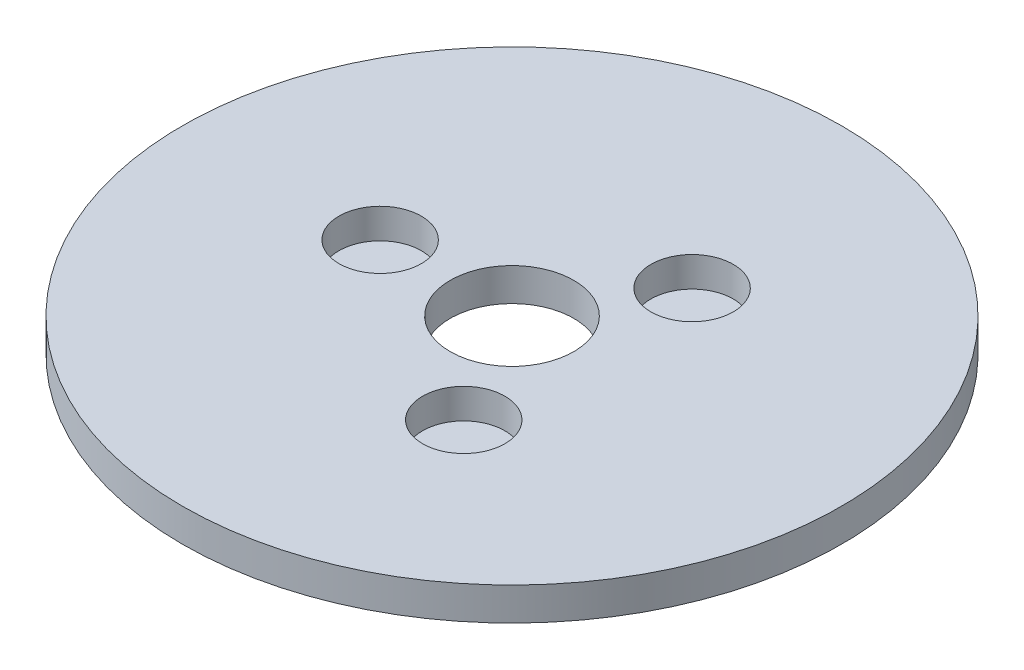
ISO-10303-21;
HEADER;
FILE_DESCRIPTION(('STEP AP214'),'2;1');
FILE_NAME('part.step','',(''),(''),'','','');
FILE_SCHEMA(('AUTOMOTIVE_DESIGN { 1 0 10303 214 1 1 1 1 }'));
ENDSEC;
DATA;
#1=APPLICATION_CONTEXT('core data for automotive mechanical design processes');
#2=APPLICATION_PROTOCOL_DEFINITION('international standard','automotive_design',2000,#1);
#3=PRODUCT_CONTEXT('',#1,'mechanical');
#4=PRODUCT('Part','Part','',(#3));
#5=PRODUCT_RELATED_PRODUCT_CATEGORY('part','',(#4));
#6=PRODUCT_DEFINITION_FORMATION('','',#4);
#7=PRODUCT_DEFINITION_CONTEXT('part definition',#1,'design');
#8=PRODUCT_DEFINITION('design','',#6,#7);
#9=PRODUCT_DEFINITION_SHAPE('','',#8);
#10=(LENGTH_UNIT() NAMED_UNIT(*) SI_UNIT(.MILLI.,.METRE.));
#11=(NAMED_UNIT(*) PLANE_ANGLE_UNIT() SI_UNIT($,.RADIAN.));
#12=(NAMED_UNIT(*) SI_UNIT($,.STERADIAN.) SOLID_ANGLE_UNIT());
#13=UNCERTAINTY_MEASURE_WITH_UNIT(LENGTH_MEASURE(1.E-05),#10,'distance_accuracy_value','');
#14=(GEOMETRIC_REPRESENTATION_CONTEXT(3) GLOBAL_UNCERTAINTY_ASSIGNED_CONTEXT((#13)) GLOBAL_UNIT_ASSIGNED_CONTEXT((#10,
#11,#12)) REPRESENTATION_CONTEXT('',''));
#15=CARTESIAN_POINT('',(0.,0.,0.));
#16=DIRECTION('',(0.,0.,1.));
#17=DIRECTION('',(1.,0.,0.));
#18=AXIS2_PLACEMENT_3D('',#15,#16,#17);
#19=CARTESIAN_POINT('',(0.,8.,0.));
#20=DIRECTION('',(0.,-1.,0.));
#21=DIRECTION('',(0.,0.,-1.));
#22=AXIS2_PLACEMENT_3D('',#19,#20,#21);
#23=CYLINDRICAL_SURFACE('',#22,80.);
#24=CARTESIAN_POINT('',(0.,8.,0.));
#25=DIRECTION('',(0.,1.,0.));
#26=DIRECTION('',(0.,0.,1.));
#27=AXIS2_PLACEMENT_3D('',#24,#25,#26);
#28=CIRCLE('',#27,80.);
#29=CARTESIAN_POINT('',(0.,8.,80.));
#30=VERTEX_POINT('',#29);
#31=EDGE_CURVE('E10',#30,#30,#28,.T.);
#32=ORIENTED_EDGE('',*,*,#31,.F.);
#33=EDGE_LOOP('',(#32));
#34=FACE_BOUND('',#33,.T.);
#35=CARTESIAN_POINT('',(0.,0.,0.));
#36=DIRECTION('',(0.,1.,0.));
#37=DIRECTION('',(0.,0.,1.));
#38=AXIS2_PLACEMENT_3D('',#35,#36,#37);
#39=CIRCLE('',#38,80.);
#40=CARTESIAN_POINT('',(0.,0.,80.));
#41=VERTEX_POINT('',#40);
#42=EDGE_CURVE('E37',#41,#41,#39,.T.);
#43=ORIENTED_EDGE('',*,*,#42,.T.);
#44=EDGE_LOOP('',(#43));
#45=FACE_BOUND('',#44,.T.);
#46=ADVANCED_FACE('F40',(#34,#45),#23,.T.);
#47=CARTESIAN_POINT('',(0.,8.,0.));
#48=DIRECTION('',(0.,1.,0.));
#49=DIRECTION('',(0.,0.,1.));
#50=AXIS2_PLACEMENT_3D('',#47,#48,#49);
#51=PLANE('',#50);
#52=CARTESIAN_POINT('',(16.0010882866034,8.,27.7146978887921));
#53=DIRECTION('',(0.,1.,0.));
#54=DIRECTION('',(0.866025403784436,0.,-0.500000000000004));
#55=AXIS2_PLACEMENT_3D('',#52,#53,#54);
#56=CIRCLE('',#55,10.);
#57=CARTESIAN_POINT('',(24.6613423244478,8.,22.7146978887921));
#58=VERTEX_POINT('',#57);
#59=EDGE_CURVE('E70',#58,#58,#56,.T.);
#60=ORIENTED_EDGE('',*,*,#59,.F.);
#61=EDGE_LOOP('',(#60));
#62=FACE_BOUND('',#61,.T.);
#63=CARTESIAN_POINT('',(16.0010882866031,8.,-27.7146978887923));
#64=DIRECTION('',(0.,1.,0.));
#65=DIRECTION('',(-0.866025403784443,0.,-0.499999999999992));
#66=AXIS2_PLACEMENT_3D('',#63,#64,#65);
#67=CIRCLE('',#66,10.);
#68=CARTESIAN_POINT('',(7.34083424875862,8.,-32.7146978887922));
#69=VERTEX_POINT('',#68);
#70=EDGE_CURVE('E61',#69,#69,#67,.T.);
#71=ORIENTED_EDGE('',*,*,#70,.F.);
#72=EDGE_LOOP('',(#71));
#73=FACE_BOUND('',#72,.T.);
#74=CARTESIAN_POINT('',(-32.0021765732066,8.,0.));
#75=DIRECTION('',(0.,1.,0.));
#76=DIRECTION('',(0.,0.,1.));
#77=AXIS2_PLACEMENT_3D('',#74,#75,#76);
#78=CIRCLE('',#77,10.);
#79=CARTESIAN_POINT('',(-32.0021765732066,8.,10.));
#80=VERTEX_POINT('',#79);
#81=EDGE_CURVE('E54',#80,#80,#78,.T.);
#82=ORIENTED_EDGE('',*,*,#81,.F.);
#83=EDGE_LOOP('',(#82));
#84=FACE_BOUND('',#83,.T.);
#85=CARTESIAN_POINT('',(0.,8.,0.));
#86=DIRECTION('',(0.,1.,0.));
#87=DIRECTION('',(0.,0.,1.));
#88=AXIS2_PLACEMENT_3D('',#85,#86,#87);
#89=CIRCLE('',#88,15.);
#90=CARTESIAN_POINT('',(0.,8.,15.));
#91=VERTEX_POINT('',#90);
#92=EDGE_CURVE('E50',#91,#91,#89,.T.);
#93=ORIENTED_EDGE('',*,*,#92,.F.);
#94=EDGE_LOOP('',(#93));
#95=FACE_BOUND('',#94,.T.);
#96=ORIENTED_EDGE('',*,*,#31,.T.);
#97=EDGE_LOOP('',(#96));
#98=FACE_BOUND('',#97,.T.);
#99=ADVANCED_FACE('F85',(#62,#73,#84,#95,#98),#51,.T.);
#100=CARTESIAN_POINT('',(0.,0.,0.));
#101=DIRECTION('',(0.,1.,0.));
#102=DIRECTION('',(0.,0.,1.));
#103=AXIS2_PLACEMENT_3D('',#100,#101,#102);
#104=PLANE('',#103);
#105=CARTESIAN_POINT('',(0.,0.,0.));
#106=DIRECTION('',(0.,1.,0.));
#107=DIRECTION('',(0.,0.,1.));
#108=AXIS2_PLACEMENT_3D('',#105,#106,#107);
#109=CIRCLE('',#108,15.);
#110=CARTESIAN_POINT('',(0.,0.,15.));
#111=VERTEX_POINT('',#110);
#112=EDGE_CURVE('E47',#111,#111,#109,.T.);
#113=ORIENTED_EDGE('',*,*,#112,.T.);
#114=EDGE_LOOP('',(#113));
#115=FACE_BOUND('',#114,.T.);
#116=ORIENTED_EDGE('',*,*,#42,.F.);
#117=EDGE_LOOP('',(#116));
#118=FACE_BOUND('',#117,.T.);
#119=ADVANCED_FACE('F84',(#115,#118),#104,.F.);
#120=CARTESIAN_POINT('',(0.,8.,0.));
#121=DIRECTION('',(0.,-1.,0.));
#122=DIRECTION('',(0.,0.,-1.));
#123=AXIS2_PLACEMENT_3D('',#120,#121,#122);
#124=CYLINDRICAL_SURFACE('',#123,15.);
#125=ORIENTED_EDGE('',*,*,#92,.T.);
#126=EDGE_LOOP('',(#125));
#127=FACE_BOUND('',#126,.T.);
#128=ORIENTED_EDGE('',*,*,#112,.F.);
#129=EDGE_LOOP('',(#128));
#130=FACE_BOUND('',#129,.T.);
#131=ADVANCED_FACE('F91',(#127,#130),#124,.F.);
#132=CARTESIAN_POINT('',(-32.0021765732066,0.724351608047641,0.));
#133=DIRECTION('',(0.,1.,0.));
#134=DIRECTION('',(0.,0.,1.));
#135=AXIS2_PLACEMENT_3D('',#132,#133,#134);
#136=CYLINDRICAL_SURFACE('',#135,10.);
#137=CARTESIAN_POINT('',(-32.0021765732066,0.724351608047641,0.));
#138=DIRECTION('',(0.,1.,0.));
#139=DIRECTION('',(0.,0.,1.));
#140=AXIS2_PLACEMENT_3D('',#137,#138,#139);
#141=CIRCLE('',#140,10.);
#142=CARTESIAN_POINT('',(-32.0021765732066,0.724351608047641,10.));
#143=VERTEX_POINT('',#142);
#144=EDGE_CURVE('E55',#143,#143,#141,.T.);
#145=ORIENTED_EDGE('',*,*,#144,.F.);
#146=EDGE_LOOP('',(#145));
#147=FACE_BOUND('',#146,.T.);
#148=ORIENTED_EDGE('',*,*,#81,.T.);
#149=EDGE_LOOP('',(#148));
#150=FACE_BOUND('',#149,.T.);
#151=ADVANCED_FACE('F96',(#147,#150),#136,.F.);
#152=CARTESIAN_POINT('',(-32.0021765732066,0.724351608047641,0.));
#153=DIRECTION('',(0.,1.,0.));
#154=DIRECTION('',(0.,0.,1.));
#155=AXIS2_PLACEMENT_3D('',#152,#153,#154);
#156=PLANE('',#155);
#157=ORIENTED_EDGE('',*,*,#144,.T.);
#158=EDGE_LOOP('',(#157));
#159=FACE_BOUND('',#158,.T.);
#160=ADVANCED_FACE('F127',(#159),#156,.T.);
#161=CARTESIAN_POINT('',(16.0010882866031,0.724351608047641,-27.7146978887923));
#162=DIRECTION('',(0.,1.,0.));
#163=DIRECTION('',(0.,0.,1.));
#164=AXIS2_PLACEMENT_3D('',#161,#162,#163);
#165=CYLINDRICAL_SURFACE('',#164,10.);
#166=CARTESIAN_POINT('',(16.0010882866031,0.724351608047641,-27.7146978887923));
#167=DIRECTION('',(0.,1.,0.));
#168=DIRECTION('',(-0.866025403784443,0.,-0.499999999999992));
#169=AXIS2_PLACEMENT_3D('',#166,#167,#168);
#170=CIRCLE('',#169,10.);
#171=CARTESIAN_POINT('',(7.34083424875862,0.724351608047641,-32.7146978887922));
#172=VERTEX_POINT('',#171);
#173=EDGE_CURVE('E63',#172,#172,#170,.T.);
#174=ORIENTED_EDGE('',*,*,#173,.F.);
#175=EDGE_LOOP('',(#174));
#176=FACE_BOUND('',#175,.T.);
#177=ORIENTED_EDGE('',*,*,#70,.T.);
#178=EDGE_LOOP('',(#177));
#179=FACE_BOUND('',#178,.T.);
#180=ADVANCED_FACE('F133',(#176,#179),#165,.F.);
#181=CARTESIAN_POINT('',(16.0010882866031,0.724351608047641,-27.7146978887923));
#182=DIRECTION('',(0.,1.,0.));
#183=DIRECTION('',(-0.866025403784443,0.,-0.499999999999992));
#184=AXIS2_PLACEMENT_3D('',#181,#182,#183);
#185=PLANE('',#184);
#186=ORIENTED_EDGE('',*,*,#173,.T.);
#187=EDGE_LOOP('',(#186));
#188=FACE_BOUND('',#187,.T.);
#189=ADVANCED_FACE('F77',(#188),#185,.T.);
#190=CARTESIAN_POINT('',(16.0010882866034,0.724351608047641,27.7146978887921));
#191=DIRECTION('',(0.,1.,0.));
#192=DIRECTION('',(0.,0.,1.));
#193=AXIS2_PLACEMENT_3D('',#190,#191,#192);
#194=CYLINDRICAL_SURFACE('',#193,10.);
#195=CARTESIAN_POINT('',(16.0010882866034,0.724351608047641,27.7146978887921));
#196=DIRECTION('',(0.,1.,0.));
#197=DIRECTION('',(0.866025403784436,0.,-0.500000000000004));
#198=AXIS2_PLACEMENT_3D('',#195,#196,#197);
#199=CIRCLE('',#198,10.);
#200=CARTESIAN_POINT('',(24.6613423244478,0.724351608047641,22.7146978887921));
#201=VERTEX_POINT('',#200);
#202=EDGE_CURVE('E59',#201,#201,#199,.T.);
#203=ORIENTED_EDGE('',*,*,#202,.F.);
#204=EDGE_LOOP('',(#203));
#205=FACE_BOUND('',#204,.T.);
#206=ORIENTED_EDGE('',*,*,#59,.T.);
#207=EDGE_LOOP('',(#206));
#208=FACE_BOUND('',#207,.T.);
#209=ADVANCED_FACE('F73',(#205,#208),#194,.F.);
#210=CARTESIAN_POINT('',(16.0010882866034,0.724351608047641,27.7146978887921));
#211=DIRECTION('',(0.,1.,0.));
#212=DIRECTION('',(0.866025403784436,0.,-0.500000000000004));
#213=AXIS2_PLACEMENT_3D('',#210,#211,#212);
#214=PLANE('',#213);
#215=ORIENTED_EDGE('',*,*,#202,.T.);
#216=EDGE_LOOP('',(#215));
#217=FACE_BOUND('',#216,.T.);
#218=ADVANCED_FACE('F71',(#217),#214,.T.);
#219=CLOSED_SHELL('',(#46,#99,#119,#131,#151,#160,#180,#189,#209,#218));
#220=MANIFOLD_SOLID_BREP('B2',#219);
#221=ADVANCED_BREP_SHAPE_REPRESENTATION('',(#18,#220),#14);
#222=SHAPE_DEFINITION_REPRESENTATION(#9,#221);
ENDSEC;
END-ISO-10303-21;
